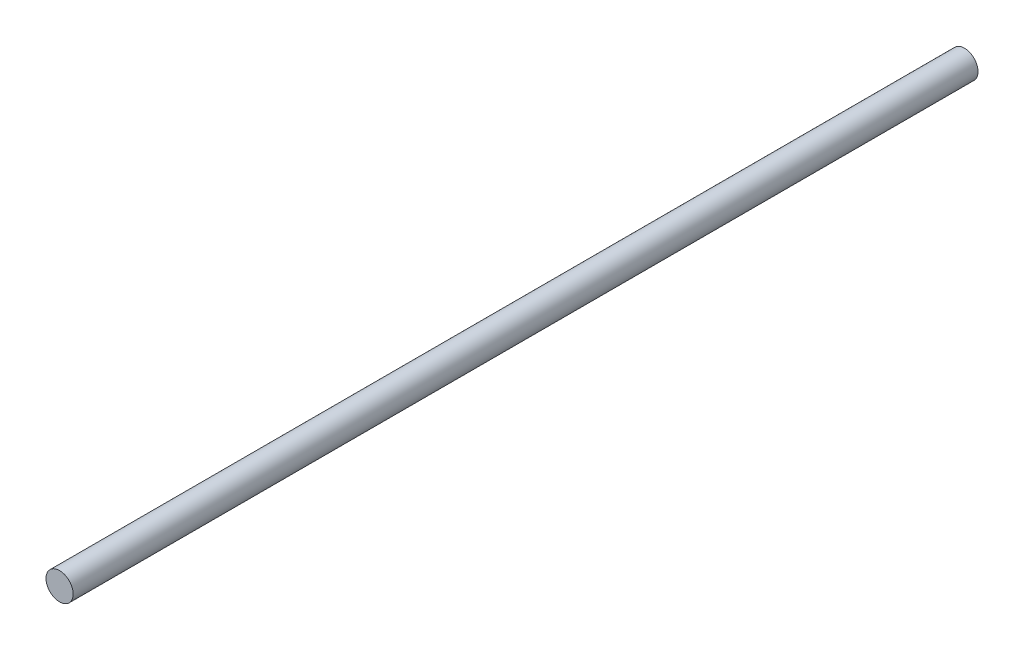
ISO-10303-21;
HEADER;
FILE_DESCRIPTION(('STEP AP214'),'2;1');
FILE_NAME('part.step','',(''),(''),'','','');
FILE_SCHEMA(('AUTOMOTIVE_DESIGN { 1 0 10303 214 1 1 1 1 }'));
ENDSEC;
DATA;
#1=APPLICATION_CONTEXT('core data for automotive mechanical design processes');
#2=APPLICATION_PROTOCOL_DEFINITION('international standard','automotive_design',2000,#1);
#3=PRODUCT_CONTEXT('',#1,'mechanical');
#4=PRODUCT('Part','Part','',(#3));
#5=PRODUCT_RELATED_PRODUCT_CATEGORY('part','',(#4));
#6=PRODUCT_DEFINITION_FORMATION('','',#4);
#7=PRODUCT_DEFINITION_CONTEXT('part definition',#1,'design');
#8=PRODUCT_DEFINITION('design','',#6,#7);
#9=PRODUCT_DEFINITION_SHAPE('','',#8);
#10=(LENGTH_UNIT() NAMED_UNIT(*) SI_UNIT(.MILLI.,.METRE.));
#11=(NAMED_UNIT(*) PLANE_ANGLE_UNIT() SI_UNIT($,.RADIAN.));
#12=(NAMED_UNIT(*) SI_UNIT($,.STERADIAN.) SOLID_ANGLE_UNIT());
#13=UNCERTAINTY_MEASURE_WITH_UNIT(LENGTH_MEASURE(1.E-05),#10,'distance_accuracy_value','');
#14=(GEOMETRIC_REPRESENTATION_CONTEXT(3) GLOBAL_UNCERTAINTY_ASSIGNED_CONTEXT((#13)) GLOBAL_UNIT_ASSIGNED_CONTEXT((#10,
#11,#12)) REPRESENTATION_CONTEXT('',''));
#15=CARTESIAN_POINT('',(0.,0.,0.));
#16=DIRECTION('',(0.,0.,1.));
#17=DIRECTION('',(1.,0.,0.));
#18=AXIS2_PLACEMENT_3D('',#15,#16,#17);
#19=CARTESIAN_POINT('',(0.,2.5,-19.));
#20=DIRECTION('',(0.,0.,-1.));
#21=DIRECTION('',(-1.,0.,0.));
#22=AXIS2_PLACEMENT_3D('',#19,#20,#21);
#23=PLANE('',#22);
#24=CARTESIAN_POINT('',(0.,2.5,-19.));
#25=DIRECTION('',(0.,0.,-1.));
#26=DIRECTION('',(-1.,0.,0.));
#27=AXIS2_PLACEMENT_3D('',#24,#25,#26);
#28=CIRCLE('',#27,0.3);
#29=CARTESIAN_POINT('',(-0.3,2.5,-19.));
#30=VERTEX_POINT('',#29);
#31=EDGE_CURVE('E17',#30,#30,#28,.F.);
#32=ORIENTED_EDGE('',*,*,#31,.F.);
#33=EDGE_LOOP('',(#32));
#34=FACE_BOUND('',#33,.T.);
#35=ADVANCED_FACE('F14',(#34),#23,.T.);
#36=CARTESIAN_POINT('',(0.,2.5,1.));
#37=DIRECTION('',(0.,0.,-1.));
#38=DIRECTION('',(-1.,0.,0.));
#39=AXIS2_PLACEMENT_3D('',#36,#37,#38);
#40=PLANE('',#39);
#41=CARTESIAN_POINT('',(0.,2.5,1.));
#42=DIRECTION('',(0.,0.,-1.));
#43=DIRECTION('',(-1.,0.,0.));
#44=AXIS2_PLACEMENT_3D('',#41,#42,#43);
#45=CIRCLE('',#44,0.3);
#46=CARTESIAN_POINT('',(-0.3,2.5,1.));
#47=VERTEX_POINT('',#46);
#48=EDGE_CURVE('E9',#47,#47,#45,.T.);
#49=ORIENTED_EDGE('',*,*,#48,.F.);
#50=EDGE_LOOP('',(#49));
#51=FACE_BOUND('',#50,.T.);
#52=ADVANCED_FACE('F29',(#51),#40,.F.);
#53=CARTESIAN_POINT('',(0.,2.5,-19.));
#54=DIRECTION('',(0.,0.,-1.));
#55=DIRECTION('',(-1.,0.,0.));
#56=AXIS2_PLACEMENT_3D('',#53,#54,#55);
#57=CYLINDRICAL_SURFACE('',#56,0.3);
#58=ORIENTED_EDGE('',*,*,#31,.T.);
#59=EDGE_LOOP('',(#58));
#60=FACE_BOUND('',#59,.T.);
#61=ORIENTED_EDGE('',*,*,#48,.T.);
#62=EDGE_LOOP('',(#61));
#63=FACE_BOUND('',#62,.T.);
#64=ADVANCED_FACE('F26',(#60,#63),#57,.T.);
#65=CLOSED_SHELL('',(#35,#52,#64));
#66=MANIFOLD_SOLID_BREP('B1',#65);
#67=ADVANCED_BREP_SHAPE_REPRESENTATION('',(#18,#66),#14);
#68=SHAPE_DEFINITION_REPRESENTATION(#9,#67);
ENDSEC;
END-ISO-10303-21;
